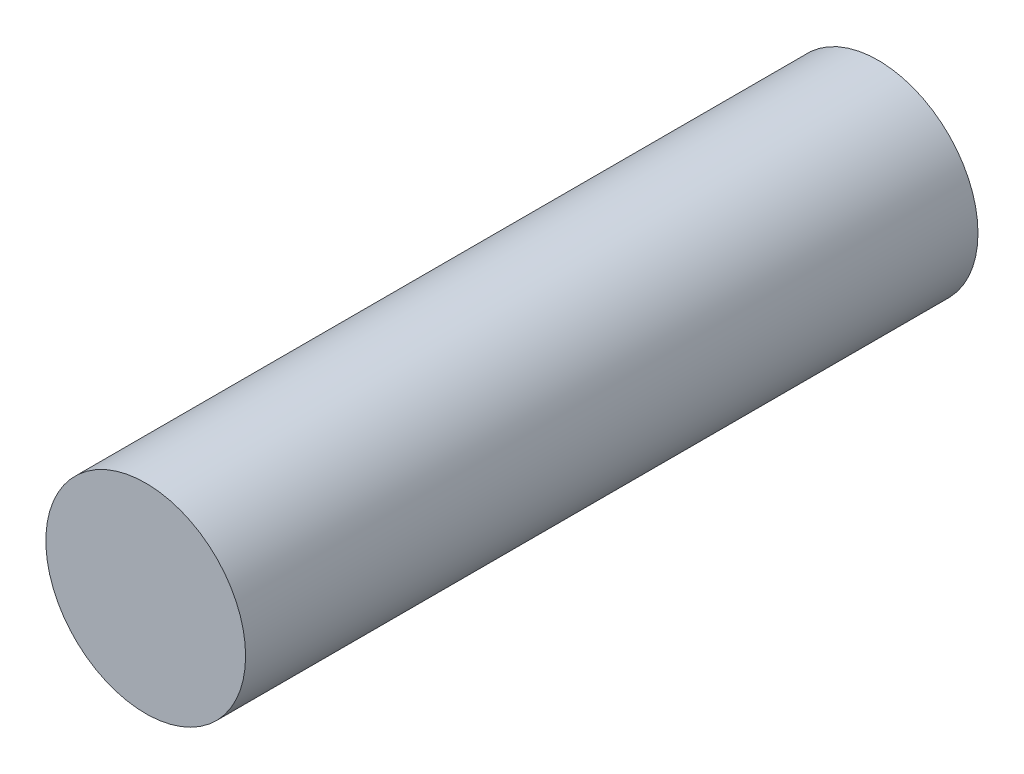
ISO-10303-21;
HEADER;
FILE_DESCRIPTION(('STEP AP214'),'2;1');
FILE_NAME('part.step','',(''),(''),'','','');
FILE_SCHEMA(('AUTOMOTIVE_DESIGN { 1 0 10303 214 1 1 1 1 }'));
ENDSEC;
DATA;
#1=APPLICATION_CONTEXT('core data for automotive mechanical design processes');
#2=APPLICATION_PROTOCOL_DEFINITION('international standard','automotive_design',2000,#1);
#3=PRODUCT_CONTEXT('',#1,'mechanical');
#4=PRODUCT('Part','Part','',(#3));
#5=PRODUCT_RELATED_PRODUCT_CATEGORY('part','',(#4));
#6=PRODUCT_DEFINITION_FORMATION('','',#4);
#7=PRODUCT_DEFINITION_CONTEXT('part definition',#1,'design');
#8=PRODUCT_DEFINITION('design','',#6,#7);
#9=PRODUCT_DEFINITION_SHAPE('','',#8);
#10=(LENGTH_UNIT() NAMED_UNIT(*) SI_UNIT(.MILLI.,.METRE.));
#11=(NAMED_UNIT(*) PLANE_ANGLE_UNIT() SI_UNIT($,.RADIAN.));
#12=(NAMED_UNIT(*) SI_UNIT($,.STERADIAN.) SOLID_ANGLE_UNIT());
#13=UNCERTAINTY_MEASURE_WITH_UNIT(LENGTH_MEASURE(1.E-05),#10,'distance_accuracy_value','');
#14=(GEOMETRIC_REPRESENTATION_CONTEXT(3) GLOBAL_UNCERTAINTY_ASSIGNED_CONTEXT((#13)) GLOBAL_UNIT_ASSIGNED_CONTEXT((#10,
#11,#12)) REPRESENTATION_CONTEXT('',''));
#15=CARTESIAN_POINT('',(0.,0.,0.));
#16=DIRECTION('',(0.,0.,1.));
#17=DIRECTION('',(1.,0.,0.));
#18=AXIS2_PLACEMENT_3D('',#15,#16,#17);
#19=CARTESIAN_POINT('',(0.,0.,110.));
#20=DIRECTION('',(0.,0.,-1.));
#21=DIRECTION('',(-1.,0.,0.));
#22=AXIS2_PLACEMENT_3D('',#19,#20,#21);
#23=CYLINDRICAL_SURFACE('',#22,15.);
#24=CARTESIAN_POINT('',(0.,0.,110.));
#25=DIRECTION('',(0.,0.,1.));
#26=DIRECTION('',(1.,0.,0.));
#27=AXIS2_PLACEMENT_3D('',#24,#25,#26);
#28=CIRCLE('',#27,15.);
#29=CARTESIAN_POINT('',(15.,0.,110.));
#30=VERTEX_POINT('',#29);
#31=EDGE_CURVE('E10',#30,#30,#28,.T.);
#32=ORIENTED_EDGE('',*,*,#31,.F.);
#33=EDGE_LOOP('',(#32));
#34=FACE_BOUND('',#33,.T.);
#35=CARTESIAN_POINT('',(0.,0.,0.));
#36=DIRECTION('',(0.,0.,1.));
#37=DIRECTION('',(1.,0.,0.));
#38=AXIS2_PLACEMENT_3D('',#35,#36,#37);
#39=CIRCLE('',#38,15.);
#40=CARTESIAN_POINT('',(15.,0.,0.));
#41=VERTEX_POINT('',#40);
#42=EDGE_CURVE('E40',#41,#41,#39,.T.);
#43=ORIENTED_EDGE('',*,*,#42,.T.);
#44=EDGE_LOOP('',(#43));
#45=FACE_BOUND('',#44,.T.);
#46=ADVANCED_FACE('F37',(#34,#45),#23,.T.);
#47=CARTESIAN_POINT('',(0.,0.,110.));
#48=DIRECTION('',(0.,0.,1.));
#49=DIRECTION('',(1.,0.,0.));
#50=AXIS2_PLACEMENT_3D('',#47,#48,#49);
#51=PLANE('',#50);
#52=ORIENTED_EDGE('',*,*,#31,.T.);
#53=EDGE_LOOP('',(#52));
#54=FACE_BOUND('',#53,.T.);
#55=ADVANCED_FACE('F54',(#54),#51,.T.);
#56=CARTESIAN_POINT('',(0.,0.,0.));
#57=DIRECTION('',(0.,0.,1.));
#58=DIRECTION('',(1.,0.,0.));
#59=AXIS2_PLACEMENT_3D('',#56,#57,#58);
#60=PLANE('',#59);
#61=ORIENTED_EDGE('',*,*,#42,.F.);
#62=EDGE_LOOP('',(#61));
#63=FACE_BOUND('',#62,.T.);
#64=ADVANCED_FACE('F52',(#63),#60,.F.);
#65=CLOSED_SHELL('',(#46,#55,#64));
#66=MANIFOLD_SOLID_BREP('B2',#65);
#67=ADVANCED_BREP_SHAPE_REPRESENTATION('',(#18,#66),#14);
#68=SHAPE_DEFINITION_REPRESENTATION(#9,#67);
ENDSEC;
END-ISO-10303-21;
